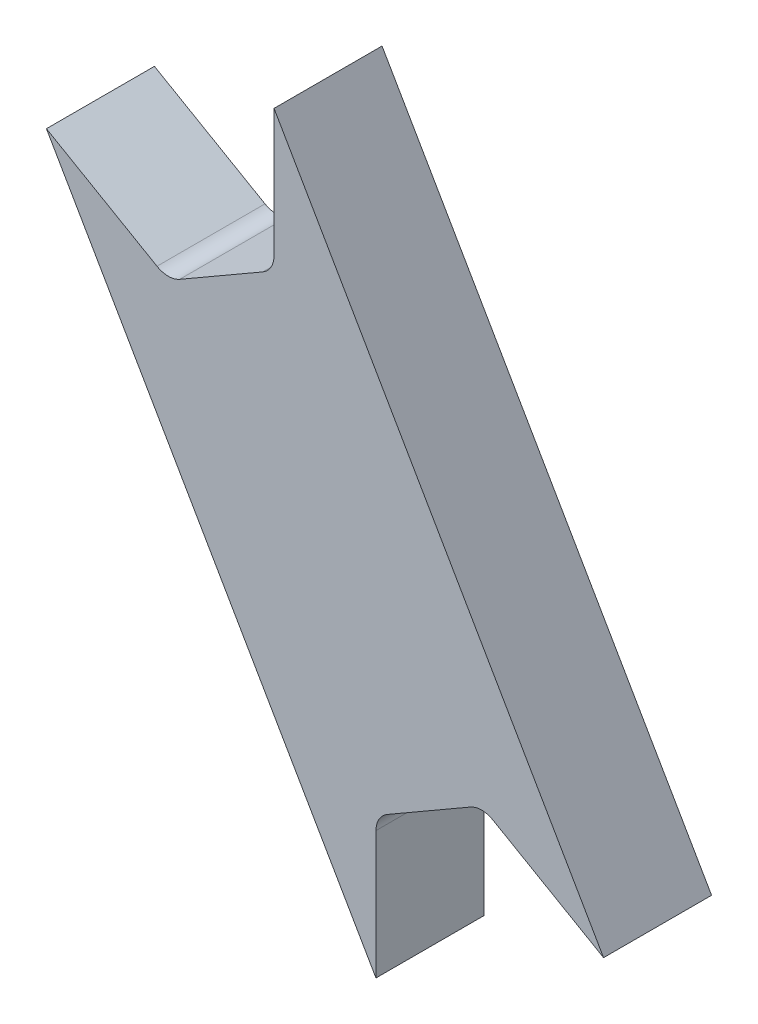
ISO-10303-21;
HEADER;
FILE_DESCRIPTION(('STEP AP214'),'2;1');
FILE_NAME('part.step','',(''),(''),'','','');
FILE_SCHEMA(('AUTOMOTIVE_DESIGN { 1 0 10303 214 1 1 1 1 }'));
ENDSEC;
DATA;
#1=APPLICATION_CONTEXT('core data for automotive mechanical design processes');
#2=APPLICATION_PROTOCOL_DEFINITION('international standard','automotive_design',2000,#1);
#3=PRODUCT_CONTEXT('',#1,'mechanical');
#4=PRODUCT('Part','Part','',(#3));
#5=PRODUCT_RELATED_PRODUCT_CATEGORY('part','',(#4));
#6=PRODUCT_DEFINITION_FORMATION('','',#4);
#7=PRODUCT_DEFINITION_CONTEXT('part definition',#1,'design');
#8=PRODUCT_DEFINITION('design','',#6,#7);
#9=PRODUCT_DEFINITION_SHAPE('','',#8);
#10=(LENGTH_UNIT() NAMED_UNIT(*) SI_UNIT(.MILLI.,.METRE.));
#11=(NAMED_UNIT(*) PLANE_ANGLE_UNIT() SI_UNIT($,.RADIAN.));
#12=(NAMED_UNIT(*) SI_UNIT($,.STERADIAN.) SOLID_ANGLE_UNIT());
#13=UNCERTAINTY_MEASURE_WITH_UNIT(LENGTH_MEASURE(1.E-05),#10,'distance_accuracy_value','');
#14=(GEOMETRIC_REPRESENTATION_CONTEXT(3) GLOBAL_UNCERTAINTY_ASSIGNED_CONTEXT((#13)) GLOBAL_UNIT_ASSIGNED_CONTEXT((#10,
#11,#12)) REPRESENTATION_CONTEXT('',''));
#15=CARTESIAN_POINT('',(0.,0.,0.));
#16=DIRECTION('',(0.,0.,1.));
#17=DIRECTION('',(1.,0.,0.));
#18=AXIS2_PLACEMENT_3D('',#15,#16,#17);
#19=CARTESIAN_POINT('',(-6.627,-3.97274720229409,-6.35));
#20=DIRECTION('',(-0.866025403784438,-0.5,0.));
#21=DIRECTION('',(0.5,-0.866025403784439,0.));
#22=AXIS2_PLACEMENT_3D('',#19,#20,#21);
#23=PLANE('',#22);
#24=DIRECTION('',(0.5,-0.866025403784439,0.));
#25=VECTOR('',#24,1.);
#26=CARTESIAN_POINT('',(-6.627,-3.97274720229409,0.));
#27=LINE('',#26,#25);
#28=CARTESIAN_POINT('',(-6.627,-3.97274720229409,0.));
#29=VERTEX_POINT('',#28);
#30=CARTESIAN_POINT('',(12.7459999999998,-37.5277674973255,0.));
#31=VERTEX_POINT('',#30);
#32=EDGE_CURVE('E156',#29,#31,#27,.T.);
#33=ORIENTED_EDGE('',*,*,#32,.F.);
#34=DIRECTION('',(0.,0.,1.));
#35=VECTOR('',#34,1.);
#36=CARTESIAN_POINT('',(-6.627,-3.97274720229409,-6.35));
#37=LINE('',#36,#35);
#38=CARTESIAN_POINT('',(-6.627,-3.97274720229409,-6.35));
#39=VERTEX_POINT('',#38);
#40=EDGE_CURVE('E11',#39,#29,#37,.T.);
#41=ORIENTED_EDGE('',*,*,#40,.F.);
#42=DIRECTION('',(0.5,-0.866025403784439,0.));
#43=VECTOR('',#42,1.);
#44=CARTESIAN_POINT('',(-6.627,-3.97274720229409,-6.35));
#45=LINE('',#44,#43);
#46=CARTESIAN_POINT('',(12.7459999999998,-37.5277674973255,-6.35));
#47=VERTEX_POINT('',#46);
#48=EDGE_CURVE('E188',#39,#47,#45,.T.);
#49=ORIENTED_EDGE('',*,*,#48,.T.);
#50=DIRECTION('',(0.,0.,1.));
#51=VECTOR('',#50,1.);
#52=CARTESIAN_POINT('',(12.7459999999998,-37.5277674973255,-6.35));
#53=LINE('',#52,#51);
#54=EDGE_CURVE('E38',#47,#31,#53,.T.);
#55=ORIENTED_EDGE('',*,*,#54,.T.);
#56=EDGE_LOOP('',(#33,#41,#49,#55));
#57=FACE_BOUND('',#56,.T.);
#58=ADVANCED_FACE('F35',(#57),#23,.T.);
#59=CARTESIAN_POINT('',(-6.627,-3.97274720229409,-6.35));
#60=DIRECTION('',(0.499999999999972,0.866025403784455,0.));
#61=DIRECTION('',(-0.866025403784455,0.499999999999972,0.));
#62=AXIS2_PLACEMENT_3D('',#59,#60,#61);
#63=PLANE('',#62);
#64=DIRECTION('',(-0.866025403784455,0.499999999999972,0.));
#65=VECTOR('',#64,1.);
#66=CARTESIAN_POINT('',(-6.627,-3.97274720229409,0.));
#67=LINE('',#66,#65);
#68=CARTESIAN_POINT('',(-0.126999999999995,-7.72552395202637,0.));
#69=VERTEX_POINT('',#68);
#70=EDGE_CURVE('E186',#69,#29,#67,.T.);
#71=ORIENTED_EDGE('',*,*,#70,.F.);
#72=DIRECTION('',(0.,0.,1.));
#73=VECTOR('',#72,1.);
#74=CARTESIAN_POINT('',(-0.126999999999995,-7.72552395202637,-6.35));
#75=LINE('',#74,#73);
#76=CARTESIAN_POINT('',(-0.126999999999995,-7.72552395202637,-6.35));
#77=VERTEX_POINT('',#76);
#78=EDGE_CURVE('E44',#77,#69,#75,.T.);
#79=ORIENTED_EDGE('',*,*,#78,.F.);
#80=DIRECTION('',(-0.866025403784455,0.499999999999972,0.));
#81=VECTOR('',#80,1.);
#82=CARTESIAN_POINT('',(-6.627,-3.97274720229409,-6.35));
#83=LINE('',#82,#81);
#84=EDGE_CURVE('E146',#77,#39,#83,.T.);
#85=ORIENTED_EDGE('',*,*,#84,.T.);
#86=ORIENTED_EDGE('',*,*,#40,.T.);
#87=EDGE_LOOP('',(#71,#79,#85,#86));
#88=FACE_BOUND('',#87,.T.);
#89=ADVANCED_FACE('F208',(#88),#63,.T.);
#90=CARTESIAN_POINT('',(0.539750000000005,-6.57067907607973,-6.35));
#91=DIRECTION('',(0.,0.,1.));
#92=DIRECTION('',(1.,0.,0.));
#93=AXIS2_PLACEMENT_3D('',#90,#91,#92);
#94=CYLINDRICAL_SURFACE('',#93,1.33350000000008);
#95=CARTESIAN_POINT('',(0.539750000000005,-6.57067907607973,0.));
#96=DIRECTION('',(0.,0.,-1.));
#97=DIRECTION('',(1.,0.,0.));
#98=AXIS2_PLACEMENT_3D('',#95,#96,#97);
#99=CIRCLE('',#98,1.33350000000008);
#100=CARTESIAN_POINT('',(1.20650000000004,-7.72552395202635,0.));
#101=VERTEX_POINT('',#100);
#102=EDGE_CURVE('E133',#101,#69,#99,.T.);
#103=ORIENTED_EDGE('',*,*,#102,.F.);
#104=DIRECTION('',(0.,0.,1.));
#105=VECTOR('',#104,1.);
#106=CARTESIAN_POINT('',(1.20650000000004,-7.72552395202635,-6.35));
#107=LINE('',#106,#105);
#108=CARTESIAN_POINT('',(1.20650000000004,-7.72552395202635,-6.35));
#109=VERTEX_POINT('',#108);
#110=EDGE_CURVE('E128',#109,#101,#107,.T.);
#111=ORIENTED_EDGE('',*,*,#110,.F.);
#112=CARTESIAN_POINT('',(0.539750000000005,-6.57067907607973,-6.35));
#113=DIRECTION('',(0.,0.,-1.));
#114=DIRECTION('',(1.,0.,0.));
#115=AXIS2_PLACEMENT_3D('',#112,#113,#114);
#116=CIRCLE('',#115,1.33350000000008);
#117=EDGE_CURVE('E131',#109,#77,#116,.T.);
#118=ORIENTED_EDGE('',*,*,#117,.T.);
#119=ORIENTED_EDGE('',*,*,#78,.T.);
#120=EDGE_LOOP('',(#103,#111,#118,#119));
#121=FACE_BOUND('',#120,.T.);
#122=ADVANCED_FACE('F130',(#121),#94,.F.);
#123=CARTESIAN_POINT('',(1.20650000000005,-7.72552395202635,-6.35));
#124=DIRECTION('',(-0.5,0.866025403784438,0.));
#125=DIRECTION('',(-0.866025403784439,-0.5,0.));
#126=AXIS2_PLACEMENT_3D('',#123,#124,#125);
#127=PLANE('',#126);
#128=DIRECTION('',(-0.866025403784438,-0.5,0.));
#129=VECTOR('',#128,1.);
#130=CARTESIAN_POINT('',(1.20650000000005,-7.72552395202635,0.));
#131=LINE('',#130,#129);
#132=CARTESIAN_POINT('',(6.08724999999989,-4.90762162567917,0.));
#133=VERTEX_POINT('',#132);
#134=EDGE_CURVE('E183',#133,#101,#131,.T.);
#135=ORIENTED_EDGE('',*,*,#134,.F.);
#136=DIRECTION('',(0.,0.,1.));
#137=VECTOR('',#136,1.);
#138=CARTESIAN_POINT('',(6.08724999999989,-4.90762162567917,-6.35));
#139=LINE('',#138,#137);
#140=CARTESIAN_POINT('',(6.08724999999989,-4.90762162567917,-6.35));
#141=VERTEX_POINT('',#140);
#142=EDGE_CURVE('E138',#141,#133,#139,.T.);
#143=ORIENTED_EDGE('',*,*,#142,.F.);
#144=DIRECTION('',(-0.866025403784438,-0.5,0.));
#145=VECTOR('',#144,1.);
#146=CARTESIAN_POINT('',(1.20650000000005,-7.72552395202635,-6.35));
#147=LINE('',#146,#145);
#148=EDGE_CURVE('E144',#141,#109,#147,.T.);
#149=ORIENTED_EDGE('',*,*,#148,.T.);
#150=ORIENTED_EDGE('',*,*,#110,.T.);
#151=EDGE_LOOP('',(#135,#143,#149,#150));
#152=FACE_BOUND('',#151,.T.);
#153=ADVANCED_FACE('F148',(#152),#127,.T.);
#154=CARTESIAN_POINT('',(5.42049999999985,-3.75277674973256,-6.35));
#155=DIRECTION('',(0.,0.,1.));
#156=DIRECTION('',(1.,0.,0.));
#157=AXIS2_PLACEMENT_3D('',#154,#155,#156);
#158=CYLINDRICAL_SURFACE('',#157,1.33350000000004);
#159=CARTESIAN_POINT('',(5.42049999999985,-3.75277674973256,0.));
#160=DIRECTION('',(0.,0.,-1.));
#161=DIRECTION('',(1.,0.,0.));
#162=AXIS2_PLACEMENT_3D('',#159,#160,#161);
#163=CIRCLE('',#162,1.33350000000004);
#164=CARTESIAN_POINT('',(6.75399999999989,-3.75277674973256,0.));
#165=VERTEX_POINT('',#164);
#166=EDGE_CURVE('E180',#165,#133,#163,.T.);
#167=ORIENTED_EDGE('',*,*,#166,.F.);
#168=DIRECTION('',(0.,0.,1.));
#169=VECTOR('',#168,1.);
#170=CARTESIAN_POINT('',(6.75399999999989,-3.75277674973256,-6.35));
#171=LINE('',#170,#169);
#172=CARTESIAN_POINT('',(6.75399999999989,-3.75277674973256,-6.35));
#173=VERTEX_POINT('',#172);
#174=EDGE_CURVE('E192',#173,#165,#171,.T.);
#175=ORIENTED_EDGE('',*,*,#174,.F.);
#176=CARTESIAN_POINT('',(5.42049999999985,-3.75277674973256,-6.35));
#177=DIRECTION('',(0.,0.,-1.));
#178=DIRECTION('',(1.,0.,0.));
#179=AXIS2_PLACEMENT_3D('',#176,#177,#178);
#180=CIRCLE('',#179,1.33350000000004);
#181=EDGE_CURVE('E149',#173,#141,#180,.T.);
#182=ORIENTED_EDGE('',*,*,#181,.T.);
#183=ORIENTED_EDGE('',*,*,#142,.T.);
#184=EDGE_LOOP('',(#167,#175,#182,#183));
#185=FACE_BOUND('',#184,.T.);
#186=ADVANCED_FACE('F221',(#185),#158,.F.);
#187=CARTESIAN_POINT('',(6.754,3.75277674973258,-6.35));
#188=DIRECTION('',(-1.,0.,0.));
#189=DIRECTION('',(0.,-1.,0.));
#190=AXIS2_PLACEMENT_3D('',#187,#188,#189);
#191=PLANE('',#190);
#192=DIRECTION('',(0.,-1.,0.));
#193=VECTOR('',#192,1.);
#194=CARTESIAN_POINT('',(6.754,3.75277674973258,0.));
#195=LINE('',#194,#193);
#196=CARTESIAN_POINT('',(6.754,3.75277674973258,0.));
#197=VERTEX_POINT('',#196);
#198=EDGE_CURVE('E177',#197,#165,#195,.T.);
#199=ORIENTED_EDGE('',*,*,#198,.F.);
#200=DIRECTION('',(0.,0.,1.));
#201=VECTOR('',#200,1.);
#202=CARTESIAN_POINT('',(6.754,3.75277674973258,-6.35));
#203=LINE('',#202,#201);
#204=CARTESIAN_POINT('',(6.754,3.75277674973258,-6.35));
#205=VERTEX_POINT('',#204);
#206=EDGE_CURVE('E194',#205,#197,#203,.T.);
#207=ORIENTED_EDGE('',*,*,#206,.F.);
#208=DIRECTION('',(0.,-1.,0.));
#209=VECTOR('',#208,1.);
#210=CARTESIAN_POINT('',(6.754,3.75277674973258,-6.35));
#211=LINE('',#210,#209);
#212=EDGE_CURVE('E151',#205,#173,#211,.T.);
#213=ORIENTED_EDGE('',*,*,#212,.T.);
#214=ORIENTED_EDGE('',*,*,#174,.T.);
#215=EDGE_LOOP('',(#199,#207,#213,#214));
#216=FACE_BOUND('',#215,.T.);
#217=ADVANCED_FACE('F224',(#216),#191,.T.);
#218=CARTESIAN_POINT('',(26.127,-29.8022435452993,-6.35));
#219=DIRECTION('',(0.866025403784439,0.5,0.));
#220=DIRECTION('',(-0.5,0.866025403784439,0.));
#221=AXIS2_PLACEMENT_3D('',#218,#219,#220);
#222=PLANE('',#221);
#223=DIRECTION('',(-0.5,0.866025403784439,0.));
#224=VECTOR('',#223,1.);
#225=CARTESIAN_POINT('',(26.127,-29.8022435452993,0.));
#226=LINE('',#225,#224);
#227=CARTESIAN_POINT('',(26.127,-29.8022435452993,0.));
#228=VERTEX_POINT('',#227);
#229=EDGE_CURVE('E174',#228,#197,#226,.T.);
#230=ORIENTED_EDGE('',*,*,#229,.F.);
#231=DIRECTION('',(0.,0.,1.));
#232=VECTOR('',#231,1.);
#233=CARTESIAN_POINT('',(26.127,-29.8022435452993,-6.35));
#234=LINE('',#233,#232);
#235=CARTESIAN_POINT('',(26.127,-29.8022435452993,-6.35));
#236=VERTEX_POINT('',#235);
#237=EDGE_CURVE('E196',#236,#228,#234,.T.);
#238=ORIENTED_EDGE('',*,*,#237,.F.);
#239=DIRECTION('',(-0.5,0.866025403784439,0.));
#240=VECTOR('',#239,1.);
#241=CARTESIAN_POINT('',(26.127,-29.8022435452993,-6.35));
#242=LINE('',#241,#240);
#243=EDGE_CURVE('E350',#236,#205,#242,.T.);
#244=ORIENTED_EDGE('',*,*,#243,.T.);
#245=ORIENTED_EDGE('',*,*,#206,.T.);
#246=EDGE_LOOP('',(#230,#238,#244,#245));
#247=FACE_BOUND('',#246,.T.);
#248=ADVANCED_FACE('F228',(#247),#222,.T.);
#249=CARTESIAN_POINT('',(26.127,-29.8022435452993,-6.35));
#250=DIRECTION('',(-0.5,-0.866025403784439,0.));
#251=DIRECTION('',(0.866025403784439,-0.5,0.));
#252=AXIS2_PLACEMENT_3D('',#249,#250,#251);
#253=PLANE('',#252);
#254=DIRECTION('',(0.866025403784439,-0.5,0.));
#255=VECTOR('',#254,1.);
#256=CARTESIAN_POINT('',(26.127,-29.8022435452993,0.));
#257=LINE('',#256,#255);
#258=CARTESIAN_POINT('',(19.627,-26.0494667955667,0.));
#259=VERTEX_POINT('',#258);
#260=EDGE_CURVE('E171',#259,#228,#257,.T.);
#261=ORIENTED_EDGE('',*,*,#260,.F.);
#262=DIRECTION('',(0.,0.,1.));
#263=VECTOR('',#262,1.);
#264=CARTESIAN_POINT('',(19.627,-26.0494667955667,-6.35));
#265=LINE('',#264,#263);
#266=CARTESIAN_POINT('',(19.627,-26.0494667955667,-6.35));
#267=VERTEX_POINT('',#266);
#268=EDGE_CURVE('E198',#267,#259,#265,.T.);
#269=ORIENTED_EDGE('',*,*,#268,.F.);
#270=DIRECTION('',(0.866025403784439,-0.5,0.));
#271=VECTOR('',#270,1.);
#272=CARTESIAN_POINT('',(26.127,-29.8022435452993,-6.35));
#273=LINE('',#272,#271);
#274=EDGE_CURVE('E354',#267,#236,#273,.T.);
#275=ORIENTED_EDGE('',*,*,#274,.T.);
#276=ORIENTED_EDGE('',*,*,#237,.T.);
#277=EDGE_LOOP('',(#261,#269,#275,#276));
#278=FACE_BOUND('',#277,.T.);
#279=ADVANCED_FACE('F232',(#278),#253,.T.);
#280=CARTESIAN_POINT('',(18.9602499999999,-27.2043116715134,-6.35));
#281=DIRECTION('',(0.,0.,1.));
#282=DIRECTION('',(1.,0.,0.));
#283=AXIS2_PLACEMENT_3D('',#280,#281,#282);
#284=CYLINDRICAL_SURFACE('',#283,1.3335000000001);
#285=CARTESIAN_POINT('',(18.9602499999999,-27.2043116715134,0.));
#286=DIRECTION('',(0.,0.,-1.));
#287=DIRECTION('',(-1.,0.,0.));
#288=AXIS2_PLACEMENT_3D('',#285,#286,#287);
#289=CIRCLE('',#288,1.3335000000001);
#290=CARTESIAN_POINT('',(18.2934999999999,-26.0494667955668,0.));
#291=VERTEX_POINT('',#290);
#292=EDGE_CURVE('E168',#291,#259,#289,.T.);
#293=ORIENTED_EDGE('',*,*,#292,.F.);
#294=DIRECTION('',(0.,0.,1.));
#295=VECTOR('',#294,1.);
#296=CARTESIAN_POINT('',(18.2934999999999,-26.0494667955668,-6.35));
#297=LINE('',#296,#295);
#298=CARTESIAN_POINT('',(18.2934999999999,-26.0494667955668,-6.35));
#299=VERTEX_POINT('',#298);
#300=EDGE_CURVE('E200',#299,#291,#297,.T.);
#301=ORIENTED_EDGE('',*,*,#300,.F.);
#302=CARTESIAN_POINT('',(18.9602499999999,-27.2043116715134,-6.35));
#303=DIRECTION('',(0.,0.,-1.));
#304=DIRECTION('',(-1.,0.,0.));
#305=AXIS2_PLACEMENT_3D('',#302,#303,#304);
#306=CIRCLE('',#305,1.3335000000001);
#307=EDGE_CURVE('E343',#299,#267,#306,.T.);
#308=ORIENTED_EDGE('',*,*,#307,.T.);
#309=ORIENTED_EDGE('',*,*,#268,.T.);
#310=EDGE_LOOP('',(#293,#301,#308,#309));
#311=FACE_BOUND('',#310,.T.);
#312=ADVANCED_FACE('F236',(#311),#284,.F.);
#313=CARTESIAN_POINT('',(13.41275,-28.867369121914,-6.35));
#314=DIRECTION('',(0.5,-0.866025403784438,0.));
#315=DIRECTION('',(0.866025403784439,0.5,0.));
#316=AXIS2_PLACEMENT_3D('',#313,#314,#315);
#317=PLANE('',#316);
#318=DIRECTION('',(0.866025403784438,0.5,0.));
#319=VECTOR('',#318,1.);
#320=CARTESIAN_POINT('',(13.41275,-28.867369121914,0.));
#321=LINE('',#320,#319);
#322=CARTESIAN_POINT('',(13.41275,-28.867369121914,0.));
#323=VERTEX_POINT('',#322);
#324=EDGE_CURVE('E165',#323,#291,#321,.T.);
#325=ORIENTED_EDGE('',*,*,#324,.F.);
#326=DIRECTION('',(0.,0.,1.));
#327=VECTOR('',#326,1.);
#328=CARTESIAN_POINT('',(13.41275,-28.867369121914,-6.35));
#329=LINE('',#328,#327);
#330=CARTESIAN_POINT('',(13.41275,-28.867369121914,-6.35));
#331=VERTEX_POINT('',#330);
#332=EDGE_CURVE('E202',#331,#323,#329,.T.);
#333=ORIENTED_EDGE('',*,*,#332,.F.);
#334=DIRECTION('',(0.866025403784438,0.5,0.));
#335=VECTOR('',#334,1.);
#336=CARTESIAN_POINT('',(13.41275,-28.867369121914,-6.35));
#337=LINE('',#336,#335);
#338=EDGE_CURVE('E339',#331,#299,#337,.T.);
#339=ORIENTED_EDGE('',*,*,#338,.T.);
#340=ORIENTED_EDGE('',*,*,#300,.T.);
#341=EDGE_LOOP('',(#325,#333,#339,#340));
#342=FACE_BOUND('',#341,.T.);
#343=ADVANCED_FACE('F240',(#342),#317,.T.);
#344=CARTESIAN_POINT('',(14.0795000000001,-30.0222139978606,-6.35));
#345=DIRECTION('',(0.,0.,1.));
#346=DIRECTION('',(1.,0.,0.));
#347=AXIS2_PLACEMENT_3D('',#344,#345,#346);
#348=CYLINDRICAL_SURFACE('',#347,1.33350000000006);
#349=CARTESIAN_POINT('',(14.0795000000001,-30.0222139978606,0.));
#350=DIRECTION('',(0.,0.,-1.));
#351=DIRECTION('',(-1.,0.,0.));
#352=AXIS2_PLACEMENT_3D('',#349,#350,#351);
#353=CIRCLE('',#352,1.33350000000006);
#354=CARTESIAN_POINT('',(12.746,-30.0222139978605,0.));
#355=VERTEX_POINT('',#354);
#356=EDGE_CURVE('E162',#355,#323,#353,.T.);
#357=ORIENTED_EDGE('',*,*,#356,.F.);
#358=DIRECTION('',(0.,0.,1.));
#359=VECTOR('',#358,1.);
#360=CARTESIAN_POINT('',(12.746,-30.0222139978605,-6.35));
#361=LINE('',#360,#359);
#362=CARTESIAN_POINT('',(12.746,-30.0222139978605,-6.35));
#363=VERTEX_POINT('',#362);
#364=EDGE_CURVE('E203',#363,#355,#361,.T.);
#365=ORIENTED_EDGE('',*,*,#364,.F.);
#366=CARTESIAN_POINT('',(14.0795000000001,-30.0222139978606,-6.35));
#367=DIRECTION('',(0.,0.,-1.));
#368=DIRECTION('',(-1.,0.,0.));
#369=AXIS2_PLACEMENT_3D('',#366,#367,#368);
#370=CIRCLE('',#369,1.33350000000006);
#371=EDGE_CURVE('E360',#363,#331,#370,.T.);
#372=ORIENTED_EDGE('',*,*,#371,.T.);
#373=ORIENTED_EDGE('',*,*,#332,.T.);
#374=EDGE_LOOP('',(#357,#365,#372,#373));
#375=FACE_BOUND('',#374,.T.);
#376=ADVANCED_FACE('F244',(#375),#348,.F.);
#377=CARTESIAN_POINT('',(12.7459999999998,-37.5277674973255,-6.35));
#378=DIRECTION('',(1.,0.,0.));
#379=DIRECTION('',(0.,1.,0.));
#380=AXIS2_PLACEMENT_3D('',#377,#378,#379);
#381=PLANE('',#380);
#382=DIRECTION('',(0.,1.,0.));
#383=VECTOR('',#382,1.);
#384=CARTESIAN_POINT('',(12.7459999999998,-37.5277674973255,0.));
#385=LINE('',#384,#383);
#386=EDGE_CURVE('E159',#31,#355,#385,.T.);
#387=ORIENTED_EDGE('',*,*,#386,.F.);
#388=ORIENTED_EDGE('',*,*,#54,.F.);
#389=DIRECTION('',(0.,1.,0.));
#390=VECTOR('',#389,1.);
#391=CARTESIAN_POINT('',(12.7459999999998,-37.5277674973255,-6.35));
#392=LINE('',#391,#390);
#393=EDGE_CURVE('E362',#47,#363,#392,.T.);
#394=ORIENTED_EDGE('',*,*,#393,.T.);
#395=ORIENTED_EDGE('',*,*,#364,.T.);
#396=EDGE_LOOP('',(#387,#388,#394,#395));
#397=FACE_BOUND('',#396,.T.);
#398=ADVANCED_FACE('F205',(#397),#381,.T.);
#399=CARTESIAN_POINT('',(14.0795000000001,-30.0222139978606,-6.35));
#400=DIRECTION('',(0.,0.,-1.));
#401=DIRECTION('',(-1.,0.,0.));
#402=AXIS2_PLACEMENT_3D('',#399,#400,#401);
#403=PLANE('',#402);
#404=ORIENTED_EDGE('',*,*,#48,.F.);
#405=ORIENTED_EDGE('',*,*,#84,.F.);
#406=ORIENTED_EDGE('',*,*,#117,.F.);
#407=ORIENTED_EDGE('',*,*,#148,.F.);
#408=ORIENTED_EDGE('',*,*,#181,.F.);
#409=ORIENTED_EDGE('',*,*,#212,.F.);
#410=ORIENTED_EDGE('',*,*,#243,.F.);
#411=ORIENTED_EDGE('',*,*,#274,.F.);
#412=ORIENTED_EDGE('',*,*,#307,.F.);
#413=ORIENTED_EDGE('',*,*,#338,.F.);
#414=ORIENTED_EDGE('',*,*,#371,.F.);
#415=ORIENTED_EDGE('',*,*,#393,.F.);
#416=EDGE_LOOP('',(#404,#405,#406,#407,#408,#409,#410,#411,#412,#413,#414,#415));
#417=FACE_BOUND('',#416,.T.);
#418=ADVANCED_FACE('F142',(#417),#403,.T.);
#419=CARTESIAN_POINT('',(14.0795000000001,-30.0222139978606,0.));
#420=DIRECTION('',(0.,0.,-1.));
#421=DIRECTION('',(-1.,0.,0.));
#422=AXIS2_PLACEMENT_3D('',#419,#420,#421);
#423=PLANE('',#422);
#424=ORIENTED_EDGE('',*,*,#32,.T.);
#425=ORIENTED_EDGE('',*,*,#386,.T.);
#426=ORIENTED_EDGE('',*,*,#356,.T.);
#427=ORIENTED_EDGE('',*,*,#324,.T.);
#428=ORIENTED_EDGE('',*,*,#292,.T.);
#429=ORIENTED_EDGE('',*,*,#260,.T.);
#430=ORIENTED_EDGE('',*,*,#229,.T.);
#431=ORIENTED_EDGE('',*,*,#198,.T.);
#432=ORIENTED_EDGE('',*,*,#166,.T.);
#433=ORIENTED_EDGE('',*,*,#134,.T.);
#434=ORIENTED_EDGE('',*,*,#102,.T.);
#435=ORIENTED_EDGE('',*,*,#70,.T.);
#436=EDGE_LOOP('',(#424,#425,#426,#427,#428,#429,#430,#431,#432,#433,#434,#435));
#437=FACE_BOUND('',#436,.T.);
#438=ADVANCED_FACE('F207',(#437),#423,.F.);
#439=CLOSED_SHELL('',(#58,#89,#122,#153,#186,#217,#248,#279,#312,#343,#376,#398,#418,#438));
#440=MANIFOLD_SOLID_BREP('B2',#439);
#441=ADVANCED_BREP_SHAPE_REPRESENTATION('',(#18,#440),#14);
#442=SHAPE_DEFINITION_REPRESENTATION(#9,#441);
ENDSEC;
END-ISO-10303-21;
